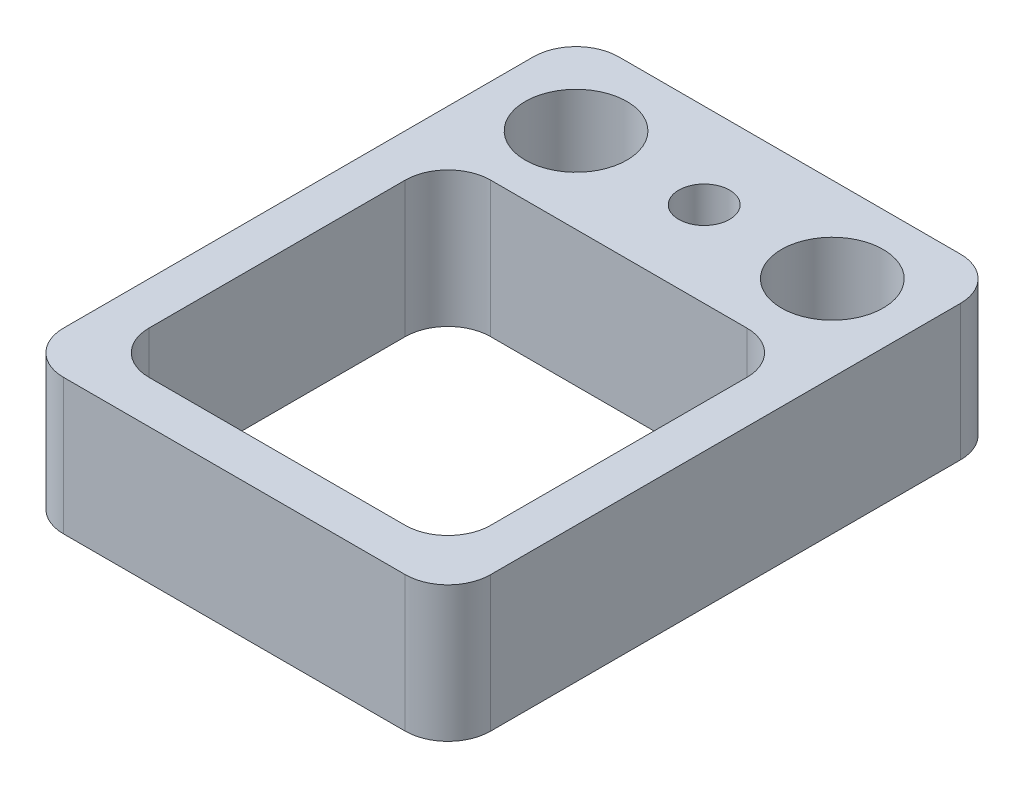
ISO-10303-21;
HEADER;
FILE_DESCRIPTION(('STEP AP214'),'2;1');
FILE_NAME('part.step','',(''),(''),'','','');
FILE_SCHEMA(('AUTOMOTIVE_DESIGN { 1 0 10303 214 1 1 1 1 }'));
ENDSEC;
DATA;
#1=APPLICATION_CONTEXT('core data for automotive mechanical design processes');
#2=APPLICATION_PROTOCOL_DEFINITION('international standard','automotive_design',2000,#1);
#3=PRODUCT_CONTEXT('',#1,'mechanical');
#4=PRODUCT('Part','Part','',(#3));
#5=PRODUCT_RELATED_PRODUCT_CATEGORY('part','',(#4));
#6=PRODUCT_DEFINITION_FORMATION('','',#4);
#7=PRODUCT_DEFINITION_CONTEXT('part definition',#1,'design');
#8=PRODUCT_DEFINITION('design','',#6,#7);
#9=PRODUCT_DEFINITION_SHAPE('','',#8);
#10=(LENGTH_UNIT() NAMED_UNIT(*) SI_UNIT(.MILLI.,.METRE.));
#11=(NAMED_UNIT(*) PLANE_ANGLE_UNIT() SI_UNIT($,.RADIAN.));
#12=(NAMED_UNIT(*) SI_UNIT($,.STERADIAN.) SOLID_ANGLE_UNIT());
#13=UNCERTAINTY_MEASURE_WITH_UNIT(LENGTH_MEASURE(1.E-05),#10,'distance_accuracy_value','');
#14=(GEOMETRIC_REPRESENTATION_CONTEXT(3) GLOBAL_UNCERTAINTY_ASSIGNED_CONTEXT((#13)) GLOBAL_UNIT_ASSIGNED_CONTEXT((#10,
#11,#12)) REPRESENTATION_CONTEXT('',''));
#15=CARTESIAN_POINT('',(0.,0.,0.));
#16=DIRECTION('',(0.,0.,1.));
#17=DIRECTION('',(1.,0.,0.));
#18=AXIS2_PLACEMENT_3D('',#15,#16,#17);
#19=CARTESIAN_POINT('',(-5.,3.175,6.5));
#20=DIRECTION('',(1.,0.,0.));
#21=DIRECTION('',(0.,0.,-1.));
#22=AXIS2_PLACEMENT_3D('',#19,#20,#21);
#23=PLANE('',#22);
#24=DIRECTION('',(0.,0.,1.));
#25=VECTOR('',#24,1.);
#26=CARTESIAN_POINT('',(-5.,0.,6.5));
#27=LINE('',#26,#25);
#28=CARTESIAN_POINT('',(-5.,0.,-5.5));
#29=VERTEX_POINT('',#28);
#30=CARTESIAN_POINT('',(-5.,0.,5.5));
#31=VERTEX_POINT('',#30);
#32=EDGE_CURVE('E183',#29,#31,#27,.T.);
#33=ORIENTED_EDGE('',*,*,#32,.T.);
#34=DIRECTION('',(0.,-1.,0.));
#35=VECTOR('',#34,1.);
#36=CARTESIAN_POINT('',(-5.,3.175,5.5));
#37=LINE('',#36,#35);
#38=CARTESIAN_POINT('',(-5.,3.175,5.5));
#39=VERTEX_POINT('',#38);
#40=EDGE_CURVE('E255',#31,#39,#37,.F.);
#41=ORIENTED_EDGE('',*,*,#40,.T.);
#42=DIRECTION('',(0.,0.,1.));
#43=VECTOR('',#42,1.);
#44=CARTESIAN_POINT('',(-5.,3.175,6.5));
#45=LINE('',#44,#43);
#46=CARTESIAN_POINT('',(-5.,3.175,-5.5));
#47=VERTEX_POINT('',#46);
#48=EDGE_CURVE('E184',#47,#39,#45,.T.);
#49=ORIENTED_EDGE('',*,*,#48,.F.);
#50=DIRECTION('',(0.,-1.,0.));
#51=VECTOR('',#50,1.);
#52=CARTESIAN_POINT('',(-5.,3.175,-5.5));
#53=LINE('',#52,#51);
#54=EDGE_CURVE('E252',#47,#29,#53,.T.);
#55=ORIENTED_EDGE('',*,*,#54,.T.);
#56=EDGE_LOOP('',(#33,#41,#49,#55));
#57=FACE_BOUND('',#56,.T.);
#58=ADVANCED_FACE('F30',(#57),#23,.F.);
#59=CARTESIAN_POINT('',(5.,3.175,6.5));
#60=DIRECTION('',(0.,0.,-1.));
#61=DIRECTION('',(-1.,0.,0.));
#62=AXIS2_PLACEMENT_3D('',#59,#60,#61);
#63=PLANE('',#62);
#64=DIRECTION('',(1.,0.,0.));
#65=VECTOR('',#64,1.);
#66=CARTESIAN_POINT('',(5.,3.175,6.5));
#67=LINE('',#66,#65);
#68=CARTESIAN_POINT('',(-4.,3.175,6.5));
#69=VERTEX_POINT('',#68);
#70=CARTESIAN_POINT('',(4.,3.175,6.5));
#71=VERTEX_POINT('',#70);
#72=EDGE_CURVE('E187',#69,#71,#67,.T.);
#73=ORIENTED_EDGE('',*,*,#72,.F.);
#74=DIRECTION('',(0.,-1.,0.));
#75=VECTOR('',#74,1.);
#76=CARTESIAN_POINT('',(-4.,3.175,6.5));
#77=LINE('',#76,#75);
#78=CARTESIAN_POINT('',(-4.,0.,6.5));
#79=VERTEX_POINT('',#78);
#80=EDGE_CURVE('E241',#69,#79,#77,.T.);
#81=ORIENTED_EDGE('',*,*,#80,.T.);
#82=DIRECTION('',(1.,0.,0.));
#83=VECTOR('',#82,1.);
#84=CARTESIAN_POINT('',(5.,0.,6.5));
#85=LINE('',#84,#83);
#86=CARTESIAN_POINT('',(4.,0.,6.5));
#87=VERTEX_POINT('',#86);
#88=EDGE_CURVE('E197',#79,#87,#85,.T.);
#89=ORIENTED_EDGE('',*,*,#88,.T.);
#90=DIRECTION('',(0.,-1.,0.));
#91=VECTOR('',#90,1.);
#92=CARTESIAN_POINT('',(4.,3.175,6.5));
#93=LINE('',#92,#91);
#94=EDGE_CURVE('E239',#87,#71,#93,.F.);
#95=ORIENTED_EDGE('',*,*,#94,.T.);
#96=EDGE_LOOP('',(#73,#81,#89,#95));
#97=FACE_BOUND('',#96,.T.);
#98=ADVANCED_FACE('F308',(#97),#63,.F.);
#99=CARTESIAN_POINT('',(5.,3.175,6.5));
#100=DIRECTION('',(-1.,0.,0.));
#101=DIRECTION('',(0.,0.,1.));
#102=AXIS2_PLACEMENT_3D('',#99,#100,#101);
#103=PLANE('',#102);
#104=DIRECTION('',(0.,0.,-1.));
#105=VECTOR('',#104,1.);
#106=CARTESIAN_POINT('',(5.,3.175,6.5));
#107=LINE('',#106,#105);
#108=CARTESIAN_POINT('',(5.,3.175,5.5));
#109=VERTEX_POINT('',#108);
#110=CARTESIAN_POINT('',(5.,3.175,-5.5));
#111=VERTEX_POINT('',#110);
#112=EDGE_CURVE('E191',#109,#111,#107,.T.);
#113=ORIENTED_EDGE('',*,*,#112,.F.);
#114=DIRECTION('',(0.,-1.,0.));
#115=VECTOR('',#114,1.);
#116=CARTESIAN_POINT('',(5.,3.175,5.5));
#117=LINE('',#116,#115);
#118=CARTESIAN_POINT('',(5.,0.,5.5));
#119=VERTEX_POINT('',#118);
#120=EDGE_CURVE('E266',#109,#119,#117,.T.);
#121=ORIENTED_EDGE('',*,*,#120,.T.);
#122=DIRECTION('',(0.,0.,-1.));
#123=VECTOR('',#122,1.);
#124=CARTESIAN_POINT('',(5.,0.,6.5));
#125=LINE('',#124,#123);
#126=CARTESIAN_POINT('',(5.,0.,-5.5));
#127=VERTEX_POINT('',#126);
#128=EDGE_CURVE('E200',#119,#127,#125,.T.);
#129=ORIENTED_EDGE('',*,*,#128,.T.);
#130=DIRECTION('',(0.,-1.,0.));
#131=VECTOR('',#130,1.);
#132=CARTESIAN_POINT('',(5.,3.175,-5.5));
#133=LINE('',#132,#131);
#134=EDGE_CURVE('E264',#127,#111,#133,.F.);
#135=ORIENTED_EDGE('',*,*,#134,.T.);
#136=EDGE_LOOP('',(#113,#121,#129,#135));
#137=FACE_BOUND('',#136,.T.);
#138=ADVANCED_FACE('F314',(#137),#103,.F.);
#139=CARTESIAN_POINT('',(5.,3.175,-6.5));
#140=DIRECTION('',(0.,0.,1.));
#141=DIRECTION('',(1.,0.,0.));
#142=AXIS2_PLACEMENT_3D('',#139,#140,#141);
#143=PLANE('',#142);
#144=DIRECTION('',(-1.,0.,0.));
#145=VECTOR('',#144,1.);
#146=CARTESIAN_POINT('',(5.,3.175,-6.5));
#147=LINE('',#146,#145);
#148=CARTESIAN_POINT('',(4.,3.175,-6.5));
#149=VERTEX_POINT('',#148);
#150=CARTESIAN_POINT('',(-4.,3.175,-6.5));
#151=VERTEX_POINT('',#150);
#152=EDGE_CURVE('E193',#149,#151,#147,.T.);
#153=ORIENTED_EDGE('',*,*,#152,.F.);
#154=DIRECTION('',(0.,-1.,0.));
#155=VECTOR('',#154,1.);
#156=CARTESIAN_POINT('',(4.,3.175,-6.5));
#157=LINE('',#156,#155);
#158=CARTESIAN_POINT('',(4.,0.,-6.5));
#159=VERTEX_POINT('',#158);
#160=EDGE_CURVE('E155',#149,#159,#157,.T.);
#161=ORIENTED_EDGE('',*,*,#160,.T.);
#162=DIRECTION('',(-1.,0.,0.));
#163=VECTOR('',#162,1.);
#164=CARTESIAN_POINT('',(5.,0.,-6.5));
#165=LINE('',#164,#163);
#166=CARTESIAN_POINT('',(-4.,0.,-6.5));
#167=VERTEX_POINT('',#166);
#168=EDGE_CURVE('E188',#159,#167,#165,.T.);
#169=ORIENTED_EDGE('',*,*,#168,.T.);
#170=DIRECTION('',(0.,-1.,0.));
#171=VECTOR('',#170,1.);
#172=CARTESIAN_POINT('',(-4.,3.175,-6.5));
#173=LINE('',#172,#171);
#174=EDGE_CURVE('E45',#167,#151,#173,.F.);
#175=ORIENTED_EDGE('',*,*,#174,.T.);
#176=EDGE_LOOP('',(#153,#161,#169,#175));
#177=FACE_BOUND('',#176,.T.);
#178=ADVANCED_FACE('F349',(#177),#143,.F.);
#179=CARTESIAN_POINT('',(-5.,3.175,-6.5));
#180=DIRECTION('',(0.,1.,0.));
#181=DIRECTION('',(0.,0.,1.));
#182=AXIS2_PLACEMENT_3D('',#179,#180,#181);
#183=PLANE('',#182);
#184=CARTESIAN_POINT('',(-3.,3.175,-4.5));
#185=DIRECTION('',(0.,1.,0.));
#186=DIRECTION('',(0.,0.,1.));
#187=AXIS2_PLACEMENT_3D('',#184,#185,#186);
#188=CIRCLE('',#187,1.190625);
#189=CARTESIAN_POINT('',(-3.,3.175,-3.309375));
#190=VERTEX_POINT('',#189);
#191=EDGE_CURVE('E224',#190,#190,#188,.T.);
#192=ORIENTED_EDGE('',*,*,#191,.F.);
#193=EDGE_LOOP('',(#192));
#194=FACE_BOUND('',#193,.T.);
#195=CARTESIAN_POINT('',(3.,3.175,-4.5));
#196=DIRECTION('',(0.,1.,0.));
#197=DIRECTION('',(0.,0.,1.));
#198=AXIS2_PLACEMENT_3D('',#195,#196,#197);
#199=CIRCLE('',#198,1.190625);
#200=CARTESIAN_POINT('',(3.,3.175,-3.309375));
#201=VERTEX_POINT('',#200);
#202=EDGE_CURVE('E220',#201,#201,#199,.T.);
#203=ORIENTED_EDGE('',*,*,#202,.F.);
#204=EDGE_LOOP('',(#203));
#205=FACE_BOUND('',#204,.T.);
#206=CARTESIAN_POINT('',(0.,3.175,-4.5));
#207=DIRECTION('',(0.,1.,0.));
#208=DIRECTION('',(0.,0.,1.));
#209=AXIS2_PLACEMENT_3D('',#206,#207,#208);
#210=CIRCLE('',#209,0.595629999999999);
#211=CARTESIAN_POINT('',(0.,3.175,-3.90437));
#212=VERTEX_POINT('',#211);
#213=EDGE_CURVE('E216',#212,#212,#210,.T.);
#214=ORIENTED_EDGE('',*,*,#213,.F.);
#215=EDGE_LOOP('',(#214));
#216=FACE_BOUND('',#215,.T.);
#217=DIRECTION('',(0.,0.,1.));
#218=VECTOR('',#217,1.);
#219=CARTESIAN_POINT('',(-4.,3.175,5.5));
#220=LINE('',#219,#218);
#221=CARTESIAN_POINT('',(-4.,3.175,-1.5));
#222=VERTEX_POINT('',#221);
#223=CARTESIAN_POINT('',(-4.,3.175,4.5));
#224=VERTEX_POINT('',#223);
#225=EDGE_CURVE('E172',#222,#224,#220,.T.);
#226=ORIENTED_EDGE('',*,*,#225,.F.);
#227=CARTESIAN_POINT('',(-3.,3.175,-1.5));
#228=DIRECTION('',(0.,1.,0.));
#229=DIRECTION('',(0.,0.,1.));
#230=AXIS2_PLACEMENT_3D('',#227,#228,#229);
#231=CIRCLE('',#230,1.);
#232=CARTESIAN_POINT('',(-3.,3.175,-2.5));
#233=VERTEX_POINT('',#232);
#234=EDGE_CURVE('E38',#222,#233,#231,.F.);
#235=ORIENTED_EDGE('',*,*,#234,.T.);
#236=DIRECTION('',(-1.,0.,0.));
#237=VECTOR('',#236,1.);
#238=CARTESIAN_POINT('',(-4.,3.175,-2.5));
#239=LINE('',#238,#237);
#240=CARTESIAN_POINT('',(3.,3.175,-2.5));
#241=VERTEX_POINT('',#240);
#242=EDGE_CURVE('E175',#241,#233,#239,.T.);
#243=ORIENTED_EDGE('',*,*,#242,.F.);
#244=CARTESIAN_POINT('',(3.,3.175,-1.5));
#245=DIRECTION('',(0.,1.,0.));
#246=DIRECTION('',(0.,0.,1.));
#247=AXIS2_PLACEMENT_3D('',#244,#245,#246);
#248=CIRCLE('',#247,1.);
#249=CARTESIAN_POINT('',(4.,3.175,-1.5));
#250=VERTEX_POINT('',#249);
#251=EDGE_CURVE('E276',#241,#250,#248,.F.);
#252=ORIENTED_EDGE('',*,*,#251,.T.);
#253=DIRECTION('',(0.,0.,-1.));
#254=VECTOR('',#253,1.);
#255=CARTESIAN_POINT('',(4.,3.175,5.5));
#256=LINE('',#255,#254);
#257=CARTESIAN_POINT('',(4.,3.175,4.5));
#258=VERTEX_POINT('',#257);
#259=EDGE_CURVE('E171',#258,#250,#256,.T.);
#260=ORIENTED_EDGE('',*,*,#259,.F.);
#261=CARTESIAN_POINT('',(3.,3.175,4.5));
#262=DIRECTION('',(0.,1.,0.));
#263=DIRECTION('',(0.,0.,1.));
#264=AXIS2_PLACEMENT_3D('',#261,#262,#263);
#265=CIRCLE('',#264,1.);
#266=CARTESIAN_POINT('',(3.,3.175,5.5));
#267=VERTEX_POINT('',#266);
#268=EDGE_CURVE('E170',#258,#267,#265,.F.);
#269=ORIENTED_EDGE('',*,*,#268,.T.);
#270=DIRECTION('',(1.,0.,0.));
#271=VECTOR('',#270,1.);
#272=CARTESIAN_POINT('',(-4.,3.175,5.5));
#273=LINE('',#272,#271);
#274=CARTESIAN_POINT('',(-3.,3.175,5.5));
#275=VERTEX_POINT('',#274);
#276=EDGE_CURVE('E161',#275,#267,#273,.T.);
#277=ORIENTED_EDGE('',*,*,#276,.F.);
#278=CARTESIAN_POINT('',(-3.,3.175,4.5));
#279=DIRECTION('',(0.,1.,0.));
#280=DIRECTION('',(0.,0.,1.));
#281=AXIS2_PLACEMENT_3D('',#278,#279,#280);
#282=CIRCLE('',#281,1.);
#283=EDGE_CURVE('E144',#275,#224,#282,.F.);
#284=ORIENTED_EDGE('',*,*,#283,.T.);
#285=EDGE_LOOP('',(#226,#235,#243,#252,#260,#269,#277,#284));
#286=FACE_BOUND('',#285,.T.);
#287=ORIENTED_EDGE('',*,*,#48,.T.);
#288=CARTESIAN_POINT('',(-4.,3.175,5.5));
#289=DIRECTION('',(0.,1.,0.));
#290=DIRECTION('',(0.,0.,1.));
#291=AXIS2_PLACEMENT_3D('',#288,#289,#290);
#292=CIRCLE('',#291,1.);
#293=EDGE_CURVE('E262',#39,#69,#292,.T.);
#294=ORIENTED_EDGE('',*,*,#293,.T.);
#295=ORIENTED_EDGE('',*,*,#72,.T.);
#296=CARTESIAN_POINT('',(4.,3.175,5.5));
#297=DIRECTION('',(0.,1.,0.));
#298=DIRECTION('',(0.,0.,1.));
#299=AXIS2_PLACEMENT_3D('',#296,#297,#298);
#300=CIRCLE('',#299,1.);
#301=EDGE_CURVE('E260',#71,#109,#300,.T.);
#302=ORIENTED_EDGE('',*,*,#301,.T.);
#303=ORIENTED_EDGE('',*,*,#112,.T.);
#304=CARTESIAN_POINT('',(4.,3.175,-5.5));
#305=DIRECTION('',(0.,1.,0.));
#306=DIRECTION('',(0.,0.,1.));
#307=AXIS2_PLACEMENT_3D('',#304,#305,#306);
#308=CIRCLE('',#307,1.);
#309=EDGE_CURVE('E52',#111,#149,#308,.T.);
#310=ORIENTED_EDGE('',*,*,#309,.T.);
#311=ORIENTED_EDGE('',*,*,#152,.T.);
#312=CARTESIAN_POINT('',(-4.,3.175,-5.5));
#313=DIRECTION('',(0.,1.,0.));
#314=DIRECTION('',(0.,0.,1.));
#315=AXIS2_PLACEMENT_3D('',#312,#313,#314);
#316=CIRCLE('',#315,1.);
#317=EDGE_CURVE('E257',#151,#47,#316,.T.);
#318=ORIENTED_EDGE('',*,*,#317,.T.);
#319=EDGE_LOOP('',(#287,#294,#295,#302,#303,#310,#311,#318));
#320=FACE_BOUND('',#319,.T.);
#321=ADVANCED_FACE('F168',(#194,#205,#216,#286,#320),#183,.T.);
#322=CARTESIAN_POINT('',(-5.,0.,-6.5));
#323=DIRECTION('',(0.,1.,0.));
#324=DIRECTION('',(0.,0.,1.));
#325=AXIS2_PLACEMENT_3D('',#322,#323,#324);
#326=PLANE('',#325);
#327=CARTESIAN_POINT('',(-3.,0.,-4.5));
#328=DIRECTION('',(0.,1.,0.));
#329=DIRECTION('',(0.,0.,1.));
#330=AXIS2_PLACEMENT_3D('',#327,#328,#329);
#331=CIRCLE('',#330,1.190625);
#332=CARTESIAN_POINT('',(-3.,0.,-3.309375));
#333=VERTEX_POINT('',#332);
#334=EDGE_CURVE('E221',#333,#333,#331,.T.);
#335=ORIENTED_EDGE('',*,*,#334,.T.);
#336=EDGE_LOOP('',(#335));
#337=FACE_BOUND('',#336,.T.);
#338=CARTESIAN_POINT('',(3.,0.,-4.5));
#339=DIRECTION('',(0.,1.,0.));
#340=DIRECTION('',(0.,0.,1.));
#341=AXIS2_PLACEMENT_3D('',#338,#339,#340);
#342=CIRCLE('',#341,1.190625);
#343=CARTESIAN_POINT('',(3.,0.,-3.309375));
#344=VERTEX_POINT('',#343);
#345=EDGE_CURVE('E217',#344,#344,#342,.T.);
#346=ORIENTED_EDGE('',*,*,#345,.T.);
#347=EDGE_LOOP('',(#346));
#348=FACE_BOUND('',#347,.T.);
#349=CARTESIAN_POINT('',(0.,0.,-4.5));
#350=DIRECTION('',(0.,1.,0.));
#351=DIRECTION('',(0.,0.,1.));
#352=AXIS2_PLACEMENT_3D('',#349,#350,#351);
#353=CIRCLE('',#352,0.595629999999999);
#354=CARTESIAN_POINT('',(0.,0.,-3.90437));
#355=VERTEX_POINT('',#354);
#356=EDGE_CURVE('E177',#355,#355,#353,.T.);
#357=ORIENTED_EDGE('',*,*,#356,.T.);
#358=EDGE_LOOP('',(#357));
#359=FACE_BOUND('',#358,.T.);
#360=DIRECTION('',(0.,0.,-1.));
#361=VECTOR('',#360,1.);
#362=CARTESIAN_POINT('',(4.,0.,-6.5));
#363=LINE('',#362,#361);
#364=CARTESIAN_POINT('',(4.,0.,4.5));
#365=VERTEX_POINT('',#364);
#366=CARTESIAN_POINT('',(4.,0.,-1.5));
#367=VERTEX_POINT('',#366);
#368=EDGE_CURVE('E205',#365,#367,#363,.T.);
#369=ORIENTED_EDGE('',*,*,#368,.T.);
#370=CARTESIAN_POINT('',(3.,0.,-1.5));
#371=DIRECTION('',(0.,1.,0.));
#372=DIRECTION('',(0.,0.,1.));
#373=AXIS2_PLACEMENT_3D('',#370,#371,#372);
#374=CIRCLE('',#373,1.);
#375=CARTESIAN_POINT('',(3.,0.,-2.5));
#376=VERTEX_POINT('',#375);
#377=EDGE_CURVE('E278',#367,#376,#374,.T.);
#378=ORIENTED_EDGE('',*,*,#377,.T.);
#379=DIRECTION('',(-1.,0.,0.));
#380=VECTOR('',#379,1.);
#381=CARTESIAN_POINT('',(-5.,0.,-2.5));
#382=LINE('',#381,#380);
#383=CARTESIAN_POINT('',(-3.,0.,-2.5));
#384=VERTEX_POINT('',#383);
#385=EDGE_CURVE('E208',#376,#384,#382,.T.);
#386=ORIENTED_EDGE('',*,*,#385,.T.);
#387=CARTESIAN_POINT('',(-3.,0.,-1.5));
#388=DIRECTION('',(0.,1.,0.));
#389=DIRECTION('',(0.,0.,1.));
#390=AXIS2_PLACEMENT_3D('',#387,#388,#389);
#391=CIRCLE('',#390,1.);
#392=CARTESIAN_POINT('',(-4.,0.,-1.5));
#393=VERTEX_POINT('',#392);
#394=EDGE_CURVE('E11',#384,#393,#391,.T.);
#395=ORIENTED_EDGE('',*,*,#394,.T.);
#396=DIRECTION('',(0.,0.,1.));
#397=VECTOR('',#396,1.);
#398=CARTESIAN_POINT('',(-4.,0.,-6.5));
#399=LINE('',#398,#397);
#400=CARTESIAN_POINT('',(-4.,0.,4.5));
#401=VERTEX_POINT('',#400);
#402=EDGE_CURVE('E211',#393,#401,#399,.T.);
#403=ORIENTED_EDGE('',*,*,#402,.T.);
#404=CARTESIAN_POINT('',(-3.,0.,4.5));
#405=DIRECTION('',(0.,1.,0.));
#406=DIRECTION('',(0.,0.,1.));
#407=AXIS2_PLACEMENT_3D('',#404,#405,#406);
#408=CIRCLE('',#407,1.);
#409=CARTESIAN_POINT('',(-3.,0.,5.5));
#410=VERTEX_POINT('',#409);
#411=EDGE_CURVE('E154',#401,#410,#408,.T.);
#412=ORIENTED_EDGE('',*,*,#411,.T.);
#413=DIRECTION('',(1.,0.,0.));
#414=VECTOR('',#413,1.);
#415=CARTESIAN_POINT('',(-5.,0.,5.5));
#416=LINE('',#415,#414);
#417=CARTESIAN_POINT('',(3.,0.,5.5));
#418=VERTEX_POINT('',#417);
#419=EDGE_CURVE('E164',#410,#418,#416,.T.);
#420=ORIENTED_EDGE('',*,*,#419,.T.);
#421=CARTESIAN_POINT('',(3.,0.,4.5));
#422=DIRECTION('',(0.,1.,0.));
#423=DIRECTION('',(0.,0.,1.));
#424=AXIS2_PLACEMENT_3D('',#421,#422,#423);
#425=CIRCLE('',#424,1.);
#426=EDGE_CURVE('E274',#418,#365,#425,.T.);
#427=ORIENTED_EDGE('',*,*,#426,.T.);
#428=EDGE_LOOP('',(#369,#378,#386,#395,#403,#412,#420,#427));
#429=FACE_BOUND('',#428,.T.);
#430=ORIENTED_EDGE('',*,*,#88,.F.);
#431=CARTESIAN_POINT('',(-4.,0.,5.5));
#432=DIRECTION('',(0.,1.,0.));
#433=DIRECTION('',(0.,0.,1.));
#434=AXIS2_PLACEMENT_3D('',#431,#432,#433);
#435=CIRCLE('',#434,1.);
#436=EDGE_CURVE('E250',#79,#31,#435,.F.);
#437=ORIENTED_EDGE('',*,*,#436,.T.);
#438=ORIENTED_EDGE('',*,*,#32,.F.);
#439=CARTESIAN_POINT('',(-4.,0.,-5.5));
#440=DIRECTION('',(0.,1.,0.));
#441=DIRECTION('',(0.,0.,1.));
#442=AXIS2_PLACEMENT_3D('',#439,#440,#441);
#443=CIRCLE('',#442,1.);
#444=EDGE_CURVE('E244',#29,#167,#443,.F.);
#445=ORIENTED_EDGE('',*,*,#444,.T.);
#446=ORIENTED_EDGE('',*,*,#168,.F.);
#447=CARTESIAN_POINT('',(4.,0.,-5.5));
#448=DIRECTION('',(0.,1.,0.));
#449=DIRECTION('',(0.,0.,1.));
#450=AXIS2_PLACEMENT_3D('',#447,#448,#449);
#451=CIRCLE('',#450,1.);
#452=EDGE_CURVE('E246',#159,#127,#451,.F.);
#453=ORIENTED_EDGE('',*,*,#452,.T.);
#454=ORIENTED_EDGE('',*,*,#128,.F.);
#455=CARTESIAN_POINT('',(4.,0.,5.5));
#456=DIRECTION('',(0.,1.,0.));
#457=DIRECTION('',(0.,0.,1.));
#458=AXIS2_PLACEMENT_3D('',#455,#456,#457);
#459=CIRCLE('',#458,1.);
#460=EDGE_CURVE('E248',#119,#87,#459,.F.);
#461=ORIENTED_EDGE('',*,*,#460,.T.);
#462=EDGE_LOOP('',(#430,#437,#438,#445,#446,#453,#454,#461));
#463=FACE_BOUND('',#462,.T.);
#464=ADVANCED_FACE('F291',(#337,#348,#359,#429,#463),#326,.F.);
#465=CARTESIAN_POINT('',(-4.,-0.325,5.5));
#466=DIRECTION('',(-1.,0.,0.));
#467=DIRECTION('',(0.,0.,1.));
#468=AXIS2_PLACEMENT_3D('',#465,#466,#467);
#469=PLANE('',#468);
#470=ORIENTED_EDGE('',*,*,#225,.T.);
#471=DIRECTION('',(0.,1.,0.));
#472=VECTOR('',#471,1.);
#473=CARTESIAN_POINT('',(-4.,0.,4.5));
#474=LINE('',#473,#472);
#475=EDGE_CURVE('E149',#224,#401,#474,.F.);
#476=ORIENTED_EDGE('',*,*,#475,.T.);
#477=ORIENTED_EDGE('',*,*,#402,.F.);
#478=DIRECTION('',(0.,1.,0.));
#479=VECTOR('',#478,1.);
#480=CARTESIAN_POINT('',(-4.,3.175,-1.5));
#481=LINE('',#480,#479);
#482=EDGE_CURVE('E165',#393,#222,#481,.T.);
#483=ORIENTED_EDGE('',*,*,#482,.T.);
#484=EDGE_LOOP('',(#470,#476,#477,#483));
#485=FACE_BOUND('',#484,.T.);
#486=ADVANCED_FACE('F294',(#485),#469,.F.);
#487=CARTESIAN_POINT('',(-4.,-0.325,-2.5));
#488=DIRECTION('',(0.,0.,-1.));
#489=DIRECTION('',(-1.,0.,0.));
#490=AXIS2_PLACEMENT_3D('',#487,#488,#489);
#491=PLANE('',#490);
#492=ORIENTED_EDGE('',*,*,#385,.F.);
#493=DIRECTION('',(0.,1.,0.));
#494=VECTOR('',#493,1.);
#495=CARTESIAN_POINT('',(3.,3.175,-2.5));
#496=LINE('',#495,#494);
#497=EDGE_CURVE('E236',#376,#241,#496,.T.);
#498=ORIENTED_EDGE('',*,*,#497,.T.);
#499=ORIENTED_EDGE('',*,*,#242,.T.);
#500=DIRECTION('',(0.,1.,0.));
#501=VECTOR('',#500,1.);
#502=CARTESIAN_POINT('',(-3.,0.,-2.5));
#503=LINE('',#502,#501);
#504=EDGE_CURVE('E234',#233,#384,#503,.F.);
#505=ORIENTED_EDGE('',*,*,#504,.T.);
#506=EDGE_LOOP('',(#492,#498,#499,#505));
#507=FACE_BOUND('',#506,.T.);
#508=ADVANCED_FACE('F285',(#507),#491,.F.);
#509=CARTESIAN_POINT('',(4.,-0.325,5.5));
#510=DIRECTION('',(1.,0.,0.));
#511=DIRECTION('',(0.,0.,-1.));
#512=AXIS2_PLACEMENT_3D('',#509,#510,#511);
#513=PLANE('',#512);
#514=ORIENTED_EDGE('',*,*,#368,.F.);
#515=DIRECTION('',(0.,1.,0.));
#516=VECTOR('',#515,1.);
#517=CARTESIAN_POINT('',(4.,3.175,4.5));
#518=LINE('',#517,#516);
#519=EDGE_CURVE('E231',#365,#258,#518,.T.);
#520=ORIENTED_EDGE('',*,*,#519,.T.);
#521=ORIENTED_EDGE('',*,*,#259,.T.);
#522=DIRECTION('',(0.,1.,0.));
#523=VECTOR('',#522,1.);
#524=CARTESIAN_POINT('',(4.,0.,-1.5));
#525=LINE('',#524,#523);
#526=EDGE_CURVE('E229',#250,#367,#525,.F.);
#527=ORIENTED_EDGE('',*,*,#526,.T.);
#528=EDGE_LOOP('',(#514,#520,#521,#527));
#529=FACE_BOUND('',#528,.T.);
#530=ADVANCED_FACE('F301',(#529),#513,.F.);
#531=CARTESIAN_POINT('',(-4.,-0.325,5.5));
#532=DIRECTION('',(0.,0.,1.));
#533=DIRECTION('',(1.,0.,0.));
#534=AXIS2_PLACEMENT_3D('',#531,#532,#533);
#535=PLANE('',#534);
#536=ORIENTED_EDGE('',*,*,#419,.F.);
#537=DIRECTION('',(0.,1.,0.));
#538=VECTOR('',#537,1.);
#539=CARTESIAN_POINT('',(-3.,3.175,5.5));
#540=LINE('',#539,#538);
#541=EDGE_CURVE('E148',#410,#275,#540,.T.);
#542=ORIENTED_EDGE('',*,*,#541,.T.);
#543=ORIENTED_EDGE('',*,*,#276,.T.);
#544=DIRECTION('',(0.,1.,0.));
#545=VECTOR('',#544,1.);
#546=CARTESIAN_POINT('',(3.,0.,5.5));
#547=LINE('',#546,#545);
#548=EDGE_CURVE('E166',#267,#418,#547,.F.);
#549=ORIENTED_EDGE('',*,*,#548,.T.);
#550=EDGE_LOOP('',(#536,#542,#543,#549));
#551=FACE_BOUND('',#550,.T.);
#552=ADVANCED_FACE('F160',(#551),#535,.F.);
#553=CARTESIAN_POINT('',(0.,3.175,-4.5));
#554=DIRECTION('',(0.,1.,0.));
#555=DIRECTION('',(0.,0.,1.));
#556=AXIS2_PLACEMENT_3D('',#553,#554,#555);
#557=CYLINDRICAL_SURFACE('',#556,0.595629999999999);
#558=ORIENTED_EDGE('',*,*,#213,.T.);
#559=EDGE_LOOP('',(#558));
#560=FACE_BOUND('',#559,.T.);
#561=ORIENTED_EDGE('',*,*,#356,.F.);
#562=EDGE_LOOP('',(#561));
#563=FACE_BOUND('',#562,.T.);
#564=ADVANCED_FACE('F396',(#560,#563),#557,.F.);
#565=CARTESIAN_POINT('',(3.,3.175,-4.5));
#566=DIRECTION('',(0.,1.,0.));
#567=DIRECTION('',(0.,0.,1.));
#568=AXIS2_PLACEMENT_3D('',#565,#566,#567);
#569=CYLINDRICAL_SURFACE('',#568,1.190625);
#570=ORIENTED_EDGE('',*,*,#202,.T.);
#571=EDGE_LOOP('',(#570));
#572=FACE_BOUND('',#571,.T.);
#573=ORIENTED_EDGE('',*,*,#345,.F.);
#574=EDGE_LOOP('',(#573));
#575=FACE_BOUND('',#574,.T.);
#576=ADVANCED_FACE('F388',(#572,#575),#569,.F.);
#577=CARTESIAN_POINT('',(-3.,3.175,-4.5));
#578=DIRECTION('',(0.,1.,0.));
#579=DIRECTION('',(0.,0.,1.));
#580=AXIS2_PLACEMENT_3D('',#577,#578,#579);
#581=CYLINDRICAL_SURFACE('',#580,1.190625);
#582=ORIENTED_EDGE('',*,*,#191,.T.);
#583=EDGE_LOOP('',(#582));
#584=FACE_BOUND('',#583,.T.);
#585=ORIENTED_EDGE('',*,*,#334,.F.);
#586=EDGE_LOOP('',(#585));
#587=FACE_BOUND('',#586,.T.);
#588=ADVANCED_FACE('F322',(#584,#587),#581,.F.);
#589=CARTESIAN_POINT('',(-3.,-0.325,4.5));
#590=DIRECTION('',(0.,-1.,0.));
#591=DIRECTION('',(0.,0.,-1.));
#592=AXIS2_PLACEMENT_3D('',#589,#590,#591);
#593=CYLINDRICAL_SURFACE('',#592,1.);
#594=ORIENTED_EDGE('',*,*,#411,.F.);
#595=ORIENTED_EDGE('',*,*,#475,.F.);
#596=ORIENTED_EDGE('',*,*,#283,.F.);
#597=ORIENTED_EDGE('',*,*,#541,.F.);
#598=EDGE_LOOP('',(#594,#595,#596,#597));
#599=FACE_BOUND('',#598,.T.);
#600=ADVANCED_FACE('F147',(#599),#593,.F.);
#601=CARTESIAN_POINT('',(3.,-0.325,4.5));
#602=DIRECTION('',(0.,-1.,0.));
#603=DIRECTION('',(0.,0.,-1.));
#604=AXIS2_PLACEMENT_3D('',#601,#602,#603);
#605=CYLINDRICAL_SURFACE('',#604,1.);
#606=ORIENTED_EDGE('',*,*,#426,.F.);
#607=ORIENTED_EDGE('',*,*,#548,.F.);
#608=ORIENTED_EDGE('',*,*,#268,.F.);
#609=ORIENTED_EDGE('',*,*,#519,.F.);
#610=EDGE_LOOP('',(#606,#607,#608,#609));
#611=FACE_BOUND('',#610,.T.);
#612=ADVANCED_FACE('F321',(#611),#605,.F.);
#613=CARTESIAN_POINT('',(3.,-0.325,-1.5));
#614=DIRECTION('',(0.,-1.,0.));
#615=DIRECTION('',(0.,0.,-1.));
#616=AXIS2_PLACEMENT_3D('',#613,#614,#615);
#617=CYLINDRICAL_SURFACE('',#616,1.);
#618=ORIENTED_EDGE('',*,*,#377,.F.);
#619=ORIENTED_EDGE('',*,*,#526,.F.);
#620=ORIENTED_EDGE('',*,*,#251,.F.);
#621=ORIENTED_EDGE('',*,*,#497,.F.);
#622=EDGE_LOOP('',(#618,#619,#620,#621));
#623=FACE_BOUND('',#622,.T.);
#624=ADVANCED_FACE('F325',(#623),#617,.F.);
#625=CARTESIAN_POINT('',(-3.,-0.325,-1.5));
#626=DIRECTION('',(0.,-1.,0.));
#627=DIRECTION('',(0.,0.,-1.));
#628=AXIS2_PLACEMENT_3D('',#625,#626,#627);
#629=CYLINDRICAL_SURFACE('',#628,1.);
#630=ORIENTED_EDGE('',*,*,#394,.F.);
#631=ORIENTED_EDGE('',*,*,#504,.F.);
#632=ORIENTED_EDGE('',*,*,#234,.F.);
#633=ORIENTED_EDGE('',*,*,#482,.F.);
#634=EDGE_LOOP('',(#630,#631,#632,#633));
#635=FACE_BOUND('',#634,.T.);
#636=ADVANCED_FACE('F288',(#635),#629,.F.);
#637=CARTESIAN_POINT('',(-4.,3.175,5.5));
#638=DIRECTION('',(0.,-1.,0.));
#639=DIRECTION('',(0.,0.,-1.));
#640=AXIS2_PLACEMENT_3D('',#637,#638,#639);
#641=CYLINDRICAL_SURFACE('',#640,1.);
#642=ORIENTED_EDGE('',*,*,#293,.F.);
#643=ORIENTED_EDGE('',*,*,#40,.F.);
#644=ORIENTED_EDGE('',*,*,#436,.F.);
#645=ORIENTED_EDGE('',*,*,#80,.F.);
#646=EDGE_LOOP('',(#642,#643,#644,#645));
#647=FACE_BOUND('',#646,.T.);
#648=ADVANCED_FACE('F332',(#647),#641,.T.);
#649=CARTESIAN_POINT('',(4.,3.175,5.5));
#650=DIRECTION('',(0.,-1.,0.));
#651=DIRECTION('',(0.,0.,-1.));
#652=AXIS2_PLACEMENT_3D('',#649,#650,#651);
#653=CYLINDRICAL_SURFACE('',#652,1.);
#654=ORIENTED_EDGE('',*,*,#301,.F.);
#655=ORIENTED_EDGE('',*,*,#94,.F.);
#656=ORIENTED_EDGE('',*,*,#460,.F.);
#657=ORIENTED_EDGE('',*,*,#120,.F.);
#658=EDGE_LOOP('',(#654,#655,#656,#657));
#659=FACE_BOUND('',#658,.T.);
#660=ADVANCED_FACE('F335',(#659),#653,.T.);
#661=CARTESIAN_POINT('',(4.,3.175,-5.5));
#662=DIRECTION('',(0.,-1.,0.));
#663=DIRECTION('',(0.,0.,-1.));
#664=AXIS2_PLACEMENT_3D('',#661,#662,#663);
#665=CYLINDRICAL_SURFACE('',#664,1.);
#666=ORIENTED_EDGE('',*,*,#309,.F.);
#667=ORIENTED_EDGE('',*,*,#134,.F.);
#668=ORIENTED_EDGE('',*,*,#452,.F.);
#669=ORIENTED_EDGE('',*,*,#160,.F.);
#670=EDGE_LOOP('',(#666,#667,#668,#669));
#671=FACE_BOUND('',#670,.T.);
#672=ADVANCED_FACE('F338',(#671),#665,.T.);
#673=CARTESIAN_POINT('',(-4.,3.175,-5.5));
#674=DIRECTION('',(0.,-1.,0.));
#675=DIRECTION('',(0.,0.,-1.));
#676=AXIS2_PLACEMENT_3D('',#673,#674,#675);
#677=CYLINDRICAL_SURFACE('',#676,1.);
#678=ORIENTED_EDGE('',*,*,#317,.F.);
#679=ORIENTED_EDGE('',*,*,#174,.F.);
#680=ORIENTED_EDGE('',*,*,#444,.F.);
#681=ORIENTED_EDGE('',*,*,#54,.F.);
#682=EDGE_LOOP('',(#678,#679,#680,#681));
#683=FACE_BOUND('',#682,.T.);
#684=ADVANCED_FACE('F32',(#683),#677,.T.);
#685=CLOSED_SHELL('',(#58,#98,#138,#178,#321,#464,#486,#508,#530,#552,#564,#576,#588,#600,#612,
#624,#636,#648,#660,#672,#684));
#686=MANIFOLD_SOLID_BREP('B2',#685);
#687=ADVANCED_BREP_SHAPE_REPRESENTATION('',(#18,#686),#14);
#688=SHAPE_DEFINITION_REPRESENTATION(#9,#687);
ENDSEC;
END-ISO-10303-21;
